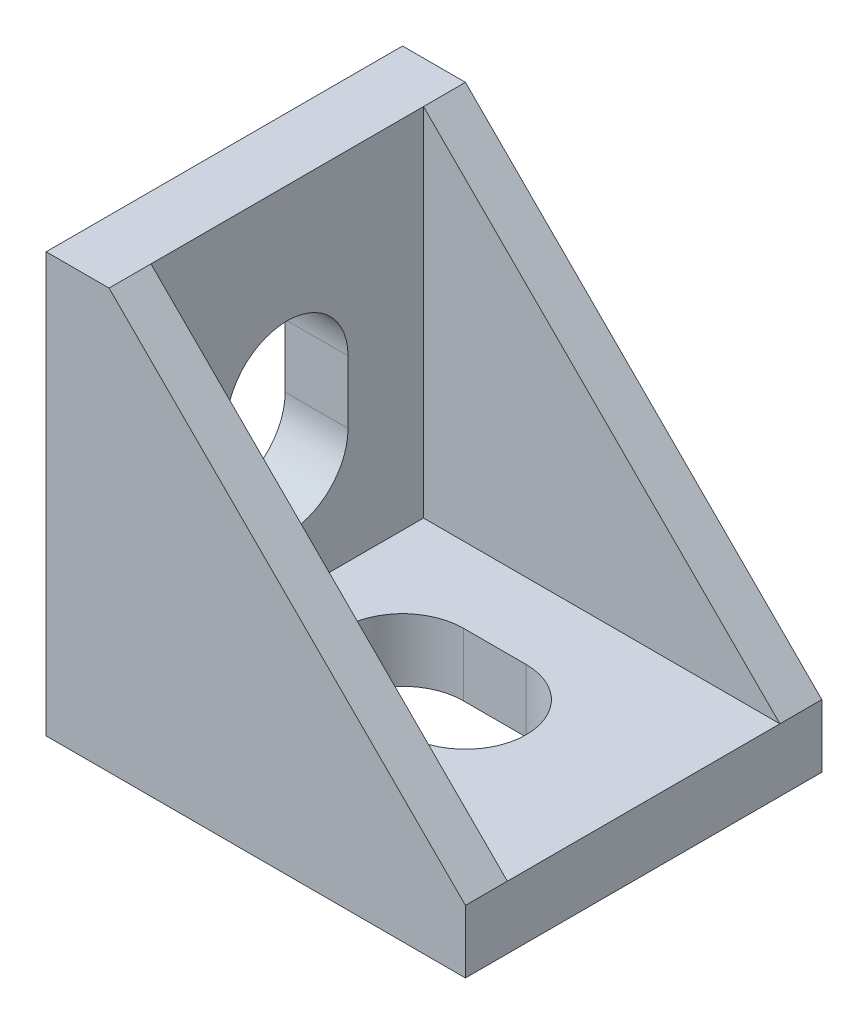
ISO-10303-21;
HEADER;
FILE_DESCRIPTION(('STEP AP214'),'2;1');
FILE_NAME('part.step','',(''),(''),'','','');
FILE_SCHEMA(('AUTOMOTIVE_DESIGN { 1 0 10303 214 1 1 1 1 }'));
ENDSEC;
DATA;
#1=APPLICATION_CONTEXT('core data for automotive mechanical design processes');
#2=APPLICATION_PROTOCOL_DEFINITION('international standard','automotive_design',2000,#1);
#3=PRODUCT_CONTEXT('',#1,'mechanical');
#4=PRODUCT('Part','Part','',(#3));
#5=PRODUCT_RELATED_PRODUCT_CATEGORY('part','',(#4));
#6=PRODUCT_DEFINITION_FORMATION('','',#4);
#7=PRODUCT_DEFINITION_CONTEXT('part definition',#1,'design');
#8=PRODUCT_DEFINITION('design','',#6,#7);
#9=PRODUCT_DEFINITION_SHAPE('','',#8);
#10=(LENGTH_UNIT() NAMED_UNIT(*) SI_UNIT(.MILLI.,.METRE.));
#11=(NAMED_UNIT(*) PLANE_ANGLE_UNIT() SI_UNIT($,.RADIAN.));
#12=(NAMED_UNIT(*) SI_UNIT($,.STERADIAN.) SOLID_ANGLE_UNIT());
#13=UNCERTAINTY_MEASURE_WITH_UNIT(LENGTH_MEASURE(1.E-05),#10,'distance_accuracy_value','');
#14=(GEOMETRIC_REPRESENTATION_CONTEXT(3) GLOBAL_UNCERTAINTY_ASSIGNED_CONTEXT((#13)) GLOBAL_UNIT_ASSIGNED_CONTEXT((#10,
#11,#12)) REPRESENTATION_CONTEXT('',''));
#15=CARTESIAN_POINT('',(0.,0.,0.));
#16=DIRECTION('',(0.,0.,1.));
#17=DIRECTION('',(1.,0.,0.));
#18=AXIS2_PLACEMENT_3D('',#15,#16,#17);
#19=CARTESIAN_POINT('',(0.,0.,8.5));
#20=DIRECTION('',(0.,1.,0.));
#21=DIRECTION('',(0.,0.,1.));
#22=AXIS2_PLACEMENT_3D('',#19,#20,#21);
#23=PLANE('',#22);
#24=DIRECTION('',(-1.,0.,0.));
#25=VECTOR('',#24,1.);
#26=CARTESIAN_POINT('',(1.5,0.,2.));
#27=LINE('',#26,#25);
#28=CARTESIAN_POINT('',(3.34999999999999,0.,2.));
#29=VERTEX_POINT('',#28);
#30=CARTESIAN_POINT('',(1.5,0.,2.));
#31=VERTEX_POINT('',#30);
#32=EDGE_CURVE('E284',#29,#31,#27,.T.);
#33=ORIENTED_EDGE('',*,*,#32,.F.);
#34=DIRECTION('',(0.,0.,-1.));
#35=VECTOR('',#34,1.);
#36=CARTESIAN_POINT('',(3.34999999999999,0.,2.));
#37=LINE('',#36,#35);
#38=CARTESIAN_POINT('',(3.34999999999999,0.,-2.));
#39=VERTEX_POINT('',#38);
#40=EDGE_CURVE('E294',#29,#39,#37,.T.);
#41=ORIENTED_EDGE('',*,*,#40,.T.);
#42=DIRECTION('',(-1.,0.,0.));
#43=VECTOR('',#42,1.);
#44=CARTESIAN_POINT('',(1.5,0.,-2.));
#45=LINE('',#44,#43);
#46=CARTESIAN_POINT('',(1.5,0.,-2.));
#47=VERTEX_POINT('',#46);
#48=EDGE_CURVE('E264',#39,#47,#45,.T.);
#49=ORIENTED_EDGE('',*,*,#48,.T.);
#50=DIRECTION('',(0.,0.,-1.));
#51=VECTOR('',#50,1.);
#52=CARTESIAN_POINT('',(1.5,0.,2.));
#53=LINE('',#52,#51);
#54=EDGE_CURVE('E58',#31,#47,#53,.T.);
#55=ORIENTED_EDGE('',*,*,#54,.F.);
#56=EDGE_LOOP('',(#33,#41,#49,#55));
#57=FACE_BOUND('',#56,.T.);
#58=DIRECTION('',(1.,0.,0.));
#59=VECTOR('',#58,1.);
#60=CARTESIAN_POINT('',(11.5,0.,2.9));
#61=LINE('',#60,#59);
#62=CARTESIAN_POINT('',(8.49999999999996,0.,2.9));
#63=VERTEX_POINT('',#62);
#64=CARTESIAN_POINT('',(11.5,0.,2.9));
#65=VERTEX_POINT('',#64);
#66=EDGE_CURVE('E381',#63,#65,#61,.T.);
#67=ORIENTED_EDGE('',*,*,#66,.T.);
#68=CARTESIAN_POINT('',(11.5,0.,0.));
#69=DIRECTION('',(0.,1.,0.));
#70=DIRECTION('',(-1.,0.,0.));
#71=AXIS2_PLACEMENT_3D('',#68,#69,#70);
#72=CIRCLE('',#71,2.9);
#73=CARTESIAN_POINT('',(11.5,0.,-2.9));
#74=VERTEX_POINT('',#73);
#75=EDGE_CURVE('E371',#65,#74,#72,.T.);
#76=ORIENTED_EDGE('',*,*,#75,.T.);
#77=DIRECTION('',(-1.,0.,0.));
#78=VECTOR('',#77,1.);
#79=CARTESIAN_POINT('',(11.5,0.,-2.9));
#80=LINE('',#79,#78);
#81=CARTESIAN_POINT('',(8.49999999999996,0.,-2.9));
#82=VERTEX_POINT('',#81);
#83=EDGE_CURVE('E374',#74,#82,#80,.T.);
#84=ORIENTED_EDGE('',*,*,#83,.T.);
#85=CARTESIAN_POINT('',(8.49999999999996,0.,0.));
#86=DIRECTION('',(0.,1.,0.));
#87=DIRECTION('',(-1.,0.,0.));
#88=AXIS2_PLACEMENT_3D('',#85,#86,#87);
#89=CIRCLE('',#88,2.9);
#90=EDGE_CURVE('E378',#82,#63,#89,.T.);
#91=ORIENTED_EDGE('',*,*,#90,.T.);
#92=EDGE_LOOP('',(#67,#76,#84,#91));
#93=FACE_BOUND('',#92,.T.);
#94=DIRECTION('',(1.,0.,0.));
#95=VECTOR('',#94,1.);
#96=CARTESIAN_POINT('',(0.,0.,-8.5));
#97=LINE('',#96,#95);
#98=CARTESIAN_POINT('',(0.,0.,-8.5));
#99=VERTEX_POINT('',#98);
#100=CARTESIAN_POINT('',(20.,0.,-8.5));
#101=VERTEX_POINT('',#100);
#102=EDGE_CURVE('E469',#99,#101,#97,.T.);
#103=ORIENTED_EDGE('',*,*,#102,.T.);
#104=DIRECTION('',(0.,0.,-1.));
#105=VECTOR('',#104,1.);
#106=CARTESIAN_POINT('',(20.,0.,8.5));
#107=LINE('',#106,#105);
#108=CARTESIAN_POINT('',(20.,0.,8.5));
#109=VERTEX_POINT('',#108);
#110=EDGE_CURVE('E483',#109,#101,#107,.T.);
#111=ORIENTED_EDGE('',*,*,#110,.F.);
#112=DIRECTION('',(1.,0.,0.));
#113=VECTOR('',#112,1.);
#114=CARTESIAN_POINT('',(0.,0.,8.5));
#115=LINE('',#114,#113);
#116=CARTESIAN_POINT('',(0.,0.,8.5));
#117=VERTEX_POINT('',#116);
#118=EDGE_CURVE('E458',#117,#109,#115,.T.);
#119=ORIENTED_EDGE('',*,*,#118,.F.);
#120=DIRECTION('',(0.,0.,-1.));
#121=VECTOR('',#120,1.);
#122=CARTESIAN_POINT('',(0.,0.,8.5));
#123=LINE('',#122,#121);
#124=EDGE_CURVE('E486',#117,#99,#123,.T.);
#125=ORIENTED_EDGE('',*,*,#124,.T.);
#126=EDGE_LOOP('',(#103,#111,#119,#125));
#127=FACE_BOUND('',#126,.T.);
#128=DIRECTION('',(-1.,0.,0.));
#129=VECTOR('',#128,1.);
#130=CARTESIAN_POINT('',(18.5,0.,2.));
#131=LINE('',#130,#129);
#132=CARTESIAN_POINT('',(18.5,0.,2.));
#133=VERTEX_POINT('',#132);
#134=CARTESIAN_POINT('',(16.65,0.,2.));
#135=VERTEX_POINT('',#134);
#136=EDGE_CURVE('E247',#133,#135,#131,.T.);
#137=ORIENTED_EDGE('',*,*,#136,.F.);
#138=DIRECTION('',(0.,0.,-1.));
#139=VECTOR('',#138,1.);
#140=CARTESIAN_POINT('',(18.5,0.,2.));
#141=LINE('',#140,#139);
#142=CARTESIAN_POINT('',(18.5,0.,-2.));
#143=VERTEX_POINT('',#142);
#144=EDGE_CURVE('E258',#133,#143,#141,.T.);
#145=ORIENTED_EDGE('',*,*,#144,.T.);
#146=DIRECTION('',(-1.,0.,0.));
#147=VECTOR('',#146,1.);
#148=CARTESIAN_POINT('',(18.5,0.,-2.));
#149=LINE('',#148,#147);
#150=CARTESIAN_POINT('',(16.65,0.,-2.));
#151=VERTEX_POINT('',#150);
#152=EDGE_CURVE('E275',#143,#151,#149,.T.);
#153=ORIENTED_EDGE('',*,*,#152,.T.);
#154=DIRECTION('',(0.,0.,-1.));
#155=VECTOR('',#154,1.);
#156=CARTESIAN_POINT('',(16.65,0.,2.));
#157=LINE('',#156,#155);
#158=EDGE_CURVE('E265',#135,#151,#157,.T.);
#159=ORIENTED_EDGE('',*,*,#158,.F.);
#160=EDGE_LOOP('',(#137,#145,#153,#159));
#161=FACE_BOUND('',#160,.T.);
#162=ADVANCED_FACE('F35',(#57,#93,#127,#161),#23,.F.);
#163=CARTESIAN_POINT('',(0.,20.,8.5));
#164=DIRECTION('',(1.,0.,0.));
#165=DIRECTION('',(0.,1.,0.));
#166=AXIS2_PLACEMENT_3D('',#163,#164,#165);
#167=PLANE('',#166);
#168=DIRECTION('',(0.,1.,0.));
#169=VECTOR('',#168,1.);
#170=CARTESIAN_POINT('',(0.,18.5,2.));
#171=LINE('',#170,#169);
#172=CARTESIAN_POINT('',(0.,16.65,2.));
#173=VERTEX_POINT('',#172);
#174=CARTESIAN_POINT('',(0.,18.5,2.));
#175=VERTEX_POINT('',#174);
#176=EDGE_CURVE('E342',#173,#175,#171,.T.);
#177=ORIENTED_EDGE('',*,*,#176,.F.);
#178=DIRECTION('',(0.,0.,-1.));
#179=VECTOR('',#178,1.);
#180=CARTESIAN_POINT('',(0.,16.65,2.));
#181=LINE('',#180,#179);
#182=CARTESIAN_POINT('',(0.,16.65,-2.));
#183=VERTEX_POINT('',#182);
#184=EDGE_CURVE('E352',#173,#183,#181,.T.);
#185=ORIENTED_EDGE('',*,*,#184,.T.);
#186=DIRECTION('',(0.,1.,0.));
#187=VECTOR('',#186,1.);
#188=CARTESIAN_POINT('',(0.,18.5,-2.));
#189=LINE('',#188,#187);
#190=CARTESIAN_POINT('',(0.,18.5,-2.));
#191=VERTEX_POINT('',#190);
#192=EDGE_CURVE('E341',#183,#191,#189,.T.);
#193=ORIENTED_EDGE('',*,*,#192,.T.);
#194=DIRECTION('',(0.,0.,-1.));
#195=VECTOR('',#194,1.);
#196=CARTESIAN_POINT('',(0.,18.5,2.));
#197=LINE('',#196,#195);
#198=EDGE_CURVE('E368',#175,#191,#197,.T.);
#199=ORIENTED_EDGE('',*,*,#198,.F.);
#200=EDGE_LOOP('',(#177,#185,#193,#199));
#201=FACE_BOUND('',#200,.T.);
#202=DIRECTION('',(0.,1.,0.));
#203=VECTOR('',#202,1.);
#204=CARTESIAN_POINT('',(0.,8.50000000000005,2.9));
#205=LINE('',#204,#203);
#206=CARTESIAN_POINT('',(0.,8.50000000000005,2.9));
#207=VERTEX_POINT('',#206);
#208=CARTESIAN_POINT('',(0.,11.5,2.9));
#209=VERTEX_POINT('',#208);
#210=EDGE_CURVE('E404',#207,#209,#205,.T.);
#211=ORIENTED_EDGE('',*,*,#210,.F.);
#212=CARTESIAN_POINT('',(0.,8.50000000000005,0.));
#213=DIRECTION('',(1.,0.,0.));
#214=DIRECTION('',(0.,1.,0.));
#215=AXIS2_PLACEMENT_3D('',#212,#213,#214);
#216=CIRCLE('',#215,2.9);
#217=CARTESIAN_POINT('',(0.,8.50000000000004,-2.9));
#218=VERTEX_POINT('',#217);
#219=EDGE_CURVE('E407',#218,#207,#216,.F.);
#220=ORIENTED_EDGE('',*,*,#219,.F.);
#221=DIRECTION('',(0.,-1.,0.));
#222=VECTOR('',#221,1.);
#223=CARTESIAN_POINT('',(0.,8.50000000000005,-2.9));
#224=LINE('',#223,#222);
#225=CARTESIAN_POINT('',(0.,11.5,-2.9));
#226=VERTEX_POINT('',#225);
#227=EDGE_CURVE('E424',#226,#218,#224,.T.);
#228=ORIENTED_EDGE('',*,*,#227,.F.);
#229=CARTESIAN_POINT('',(0.,11.5,0.));
#230=DIRECTION('',(1.,0.,0.));
#231=DIRECTION('',(0.,1.,0.));
#232=AXIS2_PLACEMENT_3D('',#229,#230,#231);
#233=CIRCLE('',#232,2.9);
#234=EDGE_CURVE('E396',#209,#226,#233,.F.);
#235=ORIENTED_EDGE('',*,*,#234,.F.);
#236=EDGE_LOOP('',(#211,#220,#228,#235));
#237=FACE_BOUND('',#236,.T.);
#238=DIRECTION('',(0.,-1.,0.));
#239=VECTOR('',#238,1.);
#240=CARTESIAN_POINT('',(0.,20.,-8.5));
#241=LINE('',#240,#239);
#242=CARTESIAN_POINT('',(0.,20.,-8.5));
#243=VERTEX_POINT('',#242);
#244=EDGE_CURVE('E467',#243,#99,#241,.T.);
#245=ORIENTED_EDGE('',*,*,#244,.T.);
#246=ORIENTED_EDGE('',*,*,#124,.F.);
#247=DIRECTION('',(0.,-1.,0.));
#248=VECTOR('',#247,1.);
#249=CARTESIAN_POINT('',(0.,20.,8.5));
#250=LINE('',#249,#248);
#251=CARTESIAN_POINT('',(0.,20.,8.5));
#252=VERTEX_POINT('',#251);
#253=EDGE_CURVE('E455',#252,#117,#250,.T.);
#254=ORIENTED_EDGE('',*,*,#253,.F.);
#255=DIRECTION('',(0.,0.,-1.));
#256=VECTOR('',#255,1.);
#257=CARTESIAN_POINT('',(0.,20.,8.5));
#258=LINE('',#257,#256);
#259=EDGE_CURVE('E489',#252,#243,#258,.T.);
#260=ORIENTED_EDGE('',*,*,#259,.T.);
#261=EDGE_LOOP('',(#245,#246,#254,#260));
#262=FACE_BOUND('',#261,.T.);
#263=DIRECTION('',(0.,1.,0.));
#264=VECTOR('',#263,1.);
#265=CARTESIAN_POINT('',(0.,1.5,2.));
#266=LINE('',#265,#264);
#267=CARTESIAN_POINT('',(0.,1.5,2.));
#268=VERTEX_POINT('',#267);
#269=CARTESIAN_POINT('',(0.,3.35,2.));
#270=VERTEX_POINT('',#269);
#271=EDGE_CURVE('E314',#268,#270,#266,.T.);
#272=ORIENTED_EDGE('',*,*,#271,.F.);
#273=DIRECTION('',(0.,0.,-1.));
#274=VECTOR('',#273,1.);
#275=CARTESIAN_POINT('',(0.,1.5,2.));
#276=LINE('',#275,#274);
#277=CARTESIAN_POINT('',(0.,1.5,-2.));
#278=VERTEX_POINT('',#277);
#279=EDGE_CURVE('E338',#268,#278,#276,.T.);
#280=ORIENTED_EDGE('',*,*,#279,.T.);
#281=DIRECTION('',(0.,1.,0.));
#282=VECTOR('',#281,1.);
#283=CARTESIAN_POINT('',(0.,1.5,-2.));
#284=LINE('',#283,#282);
#285=CARTESIAN_POINT('',(0.,3.35,-2.));
#286=VERTEX_POINT('',#285);
#287=EDGE_CURVE('E324',#278,#286,#284,.T.);
#288=ORIENTED_EDGE('',*,*,#287,.T.);
#289=DIRECTION('',(0.,0.,-1.));
#290=VECTOR('',#289,1.);
#291=CARTESIAN_POINT('',(0.,3.35,2.));
#292=LINE('',#291,#290);
#293=EDGE_CURVE('E335',#270,#286,#292,.T.);
#294=ORIENTED_EDGE('',*,*,#293,.F.);
#295=EDGE_LOOP('',(#272,#280,#288,#294));
#296=FACE_BOUND('',#295,.T.);
#297=ADVANCED_FACE('F530',(#201,#237,#262,#296),#167,.F.);
#298=CARTESIAN_POINT('',(20.,3.,8.5));
#299=DIRECTION('',(-0.707106781186547,-0.707106781186547,0.));
#300=DIRECTION('',(0.707106781186548,-0.707106781186548,0.));
#301=AXIS2_PLACEMENT_3D('',#298,#299,#300);
#302=PLANE('',#301);
#303=DIRECTION('',(0.,0.,-1.));
#304=VECTOR('',#303,1.);
#305=CARTESIAN_POINT('',(3.,20.,8.5));
#306=LINE('',#305,#304);
#307=CARTESIAN_POINT('',(3.,20.,-6.5));
#308=VERTEX_POINT('',#307);
#309=CARTESIAN_POINT('',(3.,20.,-8.5));
#310=VERTEX_POINT('',#309);
#311=EDGE_CURVE('E464',#308,#310,#306,.T.);
#312=ORIENTED_EDGE('',*,*,#311,.F.);
#313=DIRECTION('',(0.707106781186548,-0.707106781186548,0.));
#314=VECTOR('',#313,1.);
#315=CARTESIAN_POINT('',(20.,3.,-6.5));
#316=LINE('',#315,#314);
#317=CARTESIAN_POINT('',(20.,2.99999999999995,-6.5));
#318=VERTEX_POINT('',#317);
#319=EDGE_CURVE('E11',#308,#318,#316,.T.);
#320=ORIENTED_EDGE('',*,*,#319,.T.);
#321=DIRECTION('',(0.,0.,-1.));
#322=VECTOR('',#321,1.);
#323=CARTESIAN_POINT('',(20.,3.,8.5));
#324=LINE('',#323,#322);
#325=CARTESIAN_POINT('',(20.,3.,-8.5));
#326=VERTEX_POINT('',#325);
#327=EDGE_CURVE('E479',#318,#326,#324,.T.);
#328=ORIENTED_EDGE('',*,*,#327,.T.);
#329=DIRECTION('',(-0.707106781186548,0.707106781186548,0.));
#330=VECTOR('',#329,1.);
#331=CARTESIAN_POINT('',(20.,3.,-8.5));
#332=LINE('',#331,#330);
#333=EDGE_CURVE('E456',#326,#310,#332,.T.);
#334=ORIENTED_EDGE('',*,*,#333,.T.);
#335=EDGE_LOOP('',(#312,#320,#328,#334));
#336=FACE_BOUND('',#335,.T.);
#337=ADVANCED_FACE('F522',(#336),#302,.F.);
#338=CARTESIAN_POINT('',(3.,20.,8.5));
#339=DIRECTION('',(0.,-1.,0.));
#340=DIRECTION('',(1.,0.,0.));
#341=AXIS2_PLACEMENT_3D('',#338,#339,#340);
#342=PLANE('',#341);
#343=DIRECTION('',(-1.,0.,0.));
#344=VECTOR('',#343,1.);
#345=CARTESIAN_POINT('',(3.,20.,-8.5));
#346=LINE('',#345,#344);
#347=EDGE_CURVE('E450',#310,#243,#346,.T.);
#348=ORIENTED_EDGE('',*,*,#347,.T.);
#349=ORIENTED_EDGE('',*,*,#259,.F.);
#350=DIRECTION('',(-1.,0.,0.));
#351=VECTOR('',#350,1.);
#352=CARTESIAN_POINT('',(3.,20.,8.5));
#353=LINE('',#352,#351);
#354=CARTESIAN_POINT('',(3.,20.,8.5));
#355=VERTEX_POINT('',#354);
#356=EDGE_CURVE('E452',#355,#252,#353,.T.);
#357=ORIENTED_EDGE('',*,*,#356,.F.);
#358=CARTESIAN_POINT('',(3.,20.,6.5));
#359=VERTEX_POINT('',#358);
#360=EDGE_CURVE('E476',#355,#359,#306,.T.);
#361=ORIENTED_EDGE('',*,*,#360,.T.);
#362=DIRECTION('',(0.,0.,1.));
#363=VECTOR('',#362,1.);
#364=CARTESIAN_POINT('',(3.,20.,-6.5));
#365=LINE('',#364,#363);
#366=EDGE_CURVE('E433',#308,#359,#365,.T.);
#367=ORIENTED_EDGE('',*,*,#366,.F.);
#368=ORIENTED_EDGE('',*,*,#311,.T.);
#369=EDGE_LOOP('',(#348,#349,#357,#361,#367,#368));
#370=FACE_BOUND('',#369,.T.);
#371=ADVANCED_FACE('F37',(#370),#342,.F.);
#372=CARTESIAN_POINT('',(20.,0.,8.5));
#373=DIRECTION('',(-1.,0.,0.));
#374=DIRECTION('',(0.,-1.,0.));
#375=AXIS2_PLACEMENT_3D('',#372,#373,#374);
#376=PLANE('',#375);
#377=DIRECTION('',(0.,1.,0.));
#378=VECTOR('',#377,1.);
#379=CARTESIAN_POINT('',(20.,0.,-8.5));
#380=LINE('',#379,#378);
#381=EDGE_CURVE('E471',#101,#326,#380,.T.);
#382=ORIENTED_EDGE('',*,*,#381,.T.);
#383=ORIENTED_EDGE('',*,*,#327,.F.);
#384=DIRECTION('',(0.,0.,-1.));
#385=VECTOR('',#384,1.);
#386=CARTESIAN_POINT('',(20.,2.99999999999995,-6.5));
#387=LINE('',#386,#385);
#388=CARTESIAN_POINT('',(20.,2.99999999999995,6.5));
#389=VERTEX_POINT('',#388);
#390=EDGE_CURVE('E440',#389,#318,#387,.T.);
#391=ORIENTED_EDGE('',*,*,#390,.F.);
#392=CARTESIAN_POINT('',(20.,3.,8.5));
#393=VERTEX_POINT('',#392);
#394=EDGE_CURVE('E480',#393,#389,#324,.T.);
#395=ORIENTED_EDGE('',*,*,#394,.F.);
#396=DIRECTION('',(0.,1.,0.));
#397=VECTOR('',#396,1.);
#398=CARTESIAN_POINT('',(20.,0.,8.5));
#399=LINE('',#398,#397);
#400=EDGE_CURVE('E460',#109,#393,#399,.T.);
#401=ORIENTED_EDGE('',*,*,#400,.F.);
#402=ORIENTED_EDGE('',*,*,#110,.T.);
#403=EDGE_LOOP('',(#382,#383,#391,#395,#401,#402));
#404=FACE_BOUND('',#403,.T.);
#405=ADVANCED_FACE('F511',(#404),#376,.F.);
#406=ORIENTED_EDGE('',*,*,#394,.T.);
#407=DIRECTION('',(-0.707106781186548,0.707106781186548,0.));
#408=VECTOR('',#407,1.);
#409=CARTESIAN_POINT('',(20.,3.,6.5));
#410=LINE('',#409,#408);
#411=EDGE_CURVE('E43',#389,#359,#410,.T.);
#412=ORIENTED_EDGE('',*,*,#411,.T.);
#413=ORIENTED_EDGE('',*,*,#360,.F.);
#414=DIRECTION('',(-0.707106781186548,0.707106781186548,0.));
#415=VECTOR('',#414,1.);
#416=CARTESIAN_POINT('',(20.,3.,8.5));
#417=LINE('',#416,#415);
#418=EDGE_CURVE('E462',#393,#355,#417,.T.);
#419=ORIENTED_EDGE('',*,*,#418,.F.);
#420=EDGE_LOOP('',(#406,#412,#413,#419));
#421=FACE_BOUND('',#420,.T.);
#422=ADVANCED_FACE('F494',(#421),#302,.F.);
#423=CARTESIAN_POINT('',(0.,0.,8.5));
#424=DIRECTION('',(0.,0.,1.));
#425=DIRECTION('',(1.,0.,0.));
#426=AXIS2_PLACEMENT_3D('',#423,#424,#425);
#427=PLANE('',#426);
#428=ORIENTED_EDGE('',*,*,#356,.T.);
#429=ORIENTED_EDGE('',*,*,#253,.T.);
#430=ORIENTED_EDGE('',*,*,#118,.T.);
#431=ORIENTED_EDGE('',*,*,#400,.T.);
#432=ORIENTED_EDGE('',*,*,#418,.T.);
#433=EDGE_LOOP('',(#428,#429,#430,#431,#432));
#434=FACE_BOUND('',#433,.T.);
#435=ADVANCED_FACE('F504',(#434),#427,.T.);
#436=CARTESIAN_POINT('',(0.,0.,-8.5));
#437=DIRECTION('',(0.,0.,1.));
#438=DIRECTION('',(1.,0.,0.));
#439=AXIS2_PLACEMENT_3D('',#436,#437,#438);
#440=PLANE('',#439);
#441=ORIENTED_EDGE('',*,*,#347,.F.);
#442=ORIENTED_EDGE('',*,*,#333,.F.);
#443=ORIENTED_EDGE('',*,*,#381,.F.);
#444=ORIENTED_EDGE('',*,*,#102,.F.);
#445=ORIENTED_EDGE('',*,*,#244,.F.);
#446=EDGE_LOOP('',(#441,#442,#443,#444,#445));
#447=FACE_BOUND('',#446,.T.);
#448=ADVANCED_FACE('F526',(#447),#440,.F.);
#449=CARTESIAN_POINT('',(2.99999999999996,2.99999999999999,-6.5));
#450=DIRECTION('',(0.,0.,-1.));
#451=DIRECTION('',(-1.,0.,0.));
#452=AXIS2_PLACEMENT_3D('',#449,#450,#451);
#453=PLANE('',#452);
#454=DIRECTION('',(0.,1.,0.));
#455=VECTOR('',#454,1.);
#456=CARTESIAN_POINT('',(2.99999999999996,2.99999999999999,-6.5));
#457=LINE('',#456,#455);
#458=CARTESIAN_POINT('',(2.99999999999996,2.99999999999999,-6.5));
#459=VERTEX_POINT('',#458);
#460=EDGE_CURVE('E448',#459,#308,#457,.T.);
#461=ORIENTED_EDGE('',*,*,#460,.F.);
#462=DIRECTION('',(-1.,0.,0.));
#463=VECTOR('',#462,1.);
#464=CARTESIAN_POINT('',(2.99999999999996,2.99999999999999,-6.5));
#465=LINE('',#464,#463);
#466=EDGE_CURVE('E442',#318,#459,#465,.T.);
#467=ORIENTED_EDGE('',*,*,#466,.F.);
#468=ORIENTED_EDGE('',*,*,#319,.F.);
#469=EDGE_LOOP('',(#461,#467,#468));
#470=FACE_BOUND('',#469,.T.);
#471=ADVANCED_FACE('F518',(#470),#453,.F.);
#472=CARTESIAN_POINT('',(2.99999999999996,2.99999999999999,6.5));
#473=DIRECTION('',(0.,0.,1.));
#474=DIRECTION('',(1.,0.,0.));
#475=AXIS2_PLACEMENT_3D('',#472,#473,#474);
#476=PLANE('',#475);
#477=DIRECTION('',(1.,0.,0.));
#478=VECTOR('',#477,1.);
#479=CARTESIAN_POINT('',(2.99999999999996,2.99999999999999,6.5));
#480=LINE('',#479,#478);
#481=CARTESIAN_POINT('',(2.99999999999996,2.99999999999999,6.5));
#482=VERTEX_POINT('',#481);
#483=EDGE_CURVE('E437',#482,#389,#480,.T.);
#484=ORIENTED_EDGE('',*,*,#483,.F.);
#485=DIRECTION('',(0.,1.,0.));
#486=VECTOR('',#485,1.);
#487=CARTESIAN_POINT('',(2.99999999999996,2.99999999999999,6.5));
#488=LINE('',#487,#486);
#489=EDGE_CURVE('E445',#482,#359,#488,.T.);
#490=ORIENTED_EDGE('',*,*,#489,.T.);
#491=ORIENTED_EDGE('',*,*,#411,.F.);
#492=EDGE_LOOP('',(#484,#490,#491));
#493=FACE_BOUND('',#492,.T.);
#494=ADVANCED_FACE('F554',(#493),#476,.F.);
#495=CARTESIAN_POINT('',(2.99999999999996,2.99999999999999,-6.5));
#496=DIRECTION('',(-1.,0.,0.));
#497=DIRECTION('',(0.,-1.,0.));
#498=AXIS2_PLACEMENT_3D('',#495,#496,#497);
#499=PLANE('',#498);
#500=DIRECTION('',(0.,1.,0.));
#501=VECTOR('',#500,1.);
#502=CARTESIAN_POINT('',(2.99999999999998,8.50000000000004,-2.9));
#503=LINE('',#502,#501);
#504=CARTESIAN_POINT('',(2.99999999999998,8.50000000000004,-2.9));
#505=VERTEX_POINT('',#504);
#506=CARTESIAN_POINT('',(2.99999999999998,11.5,-2.9));
#507=VERTEX_POINT('',#506);
#508=EDGE_CURVE('E412',#505,#507,#503,.T.);
#509=ORIENTED_EDGE('',*,*,#508,.F.);
#510=CARTESIAN_POINT('',(2.99999999999998,8.50000000000004,0.));
#511=DIRECTION('',(1.,0.,0.));
#512=DIRECTION('',(0.,1.,0.));
#513=AXIS2_PLACEMENT_3D('',#510,#511,#512);
#514=CIRCLE('',#513,2.9);
#515=CARTESIAN_POINT('',(2.99999999999998,8.50000000000004,2.9));
#516=VERTEX_POINT('',#515);
#517=EDGE_CURVE('E410',#516,#505,#514,.T.);
#518=ORIENTED_EDGE('',*,*,#517,.F.);
#519=DIRECTION('',(0.,-1.,0.));
#520=VECTOR('',#519,1.);
#521=CARTESIAN_POINT('',(2.99999999999998,8.50000000000004,2.9));
#522=LINE('',#521,#520);
#523=CARTESIAN_POINT('',(2.99999999999998,11.5,2.9));
#524=VERTEX_POINT('',#523);
#525=EDGE_CURVE('E418',#524,#516,#522,.T.);
#526=ORIENTED_EDGE('',*,*,#525,.F.);
#527=CARTESIAN_POINT('',(2.99999999999998,11.5,0.));
#528=DIRECTION('',(1.,0.,0.));
#529=DIRECTION('',(0.,1.,0.));
#530=AXIS2_PLACEMENT_3D('',#527,#528,#529);
#531=CIRCLE('',#530,2.9);
#532=EDGE_CURVE('E415',#507,#524,#531,.T.);
#533=ORIENTED_EDGE('',*,*,#532,.F.);
#534=EDGE_LOOP('',(#509,#518,#526,#533));
#535=FACE_BOUND('',#534,.T.);
#536=ORIENTED_EDGE('',*,*,#366,.T.);
#537=ORIENTED_EDGE('',*,*,#489,.F.);
#538=DIRECTION('',(0.,0.,1.));
#539=VECTOR('',#538,1.);
#540=CARTESIAN_POINT('',(2.99999999999996,2.99999999999999,-6.5));
#541=LINE('',#540,#539);
#542=EDGE_CURVE('E434',#459,#482,#541,.T.);
#543=ORIENTED_EDGE('',*,*,#542,.F.);
#544=ORIENTED_EDGE('',*,*,#460,.T.);
#545=EDGE_LOOP('',(#536,#537,#543,#544));
#546=FACE_BOUND('',#545,.T.);
#547=ADVANCED_FACE('F551',(#535,#546),#499,.F.);
#548=CARTESIAN_POINT('',(0.,3.,0.));
#549=DIRECTION('',(0.,1.,0.));
#550=DIRECTION('',(-1.,0.,0.));
#551=AXIS2_PLACEMENT_3D('',#548,#549,#550);
#552=PLANE('',#551);
#553=CARTESIAN_POINT('',(11.5,2.99999999999997,0.));
#554=DIRECTION('',(0.,1.,0.));
#555=DIRECTION('',(-1.,0.,0.));
#556=AXIS2_PLACEMENT_3D('',#553,#554,#555);
#557=CIRCLE('',#556,2.9);
#558=CARTESIAN_POINT('',(11.5,2.99999999999997,2.9));
#559=VERTEX_POINT('',#558);
#560=CARTESIAN_POINT('',(11.5,2.99999999999997,-2.9));
#561=VERTEX_POINT('',#560);
#562=EDGE_CURVE('E370',#559,#561,#557,.T.);
#563=ORIENTED_EDGE('',*,*,#562,.F.);
#564=DIRECTION('',(1.,0.,0.));
#565=VECTOR('',#564,1.);
#566=CARTESIAN_POINT('',(11.5,2.99999999999997,2.9));
#567=LINE('',#566,#565);
#568=CARTESIAN_POINT('',(8.49999999999997,2.99999999999998,2.9));
#569=VERTEX_POINT('',#568);
#570=EDGE_CURVE('E375',#569,#559,#567,.T.);
#571=ORIENTED_EDGE('',*,*,#570,.F.);
#572=CARTESIAN_POINT('',(8.49999999999997,2.99999999999998,0.));
#573=DIRECTION('',(0.,1.,0.));
#574=DIRECTION('',(-1.,0.,0.));
#575=AXIS2_PLACEMENT_3D('',#572,#573,#574);
#576=CIRCLE('',#575,2.9);
#577=CARTESIAN_POINT('',(8.49999999999997,2.99999999999998,-2.9));
#578=VERTEX_POINT('',#577);
#579=EDGE_CURVE('E389',#578,#569,#576,.T.);
#580=ORIENTED_EDGE('',*,*,#579,.F.);
#581=DIRECTION('',(-1.,0.,0.));
#582=VECTOR('',#581,1.);
#583=CARTESIAN_POINT('',(11.5,2.99999999999997,-2.9));
#584=LINE('',#583,#582);
#585=EDGE_CURVE('E386',#561,#578,#584,.T.);
#586=ORIENTED_EDGE('',*,*,#585,.F.);
#587=EDGE_LOOP('',(#563,#571,#580,#586));
#588=FACE_BOUND('',#587,.T.);
#589=ORIENTED_EDGE('',*,*,#542,.T.);
#590=ORIENTED_EDGE('',*,*,#483,.T.);
#591=ORIENTED_EDGE('',*,*,#390,.T.);
#592=ORIENTED_EDGE('',*,*,#466,.T.);
#593=EDGE_LOOP('',(#589,#590,#591,#592));
#594=FACE_BOUND('',#593,.T.);
#595=ADVANCED_FACE('F515',(#588,#594),#552,.T.);
#596=CARTESIAN_POINT('',(-0.00100000000002789,8.50000000000005,0.));
#597=DIRECTION('',(1.,0.,0.));
#598=DIRECTION('',(0.,1.,0.));
#599=AXIS2_PLACEMENT_3D('',#596,#597,#598);
#600=CYLINDRICAL_SURFACE('',#599,2.9);
#601=ORIENTED_EDGE('',*,*,#219,.T.);
#602=DIRECTION('',(1.,0.,0.));
#603=VECTOR('',#602,1.);
#604=CARTESIAN_POINT('',(-0.00100000000002745,8.50000000000005,2.9));
#605=LINE('',#604,#603);
#606=EDGE_CURVE('E422',#207,#516,#605,.T.);
#607=ORIENTED_EDGE('',*,*,#606,.T.);
#608=ORIENTED_EDGE('',*,*,#517,.T.);
#609=DIRECTION('',(1.,0.,0.));
#610=VECTOR('',#609,1.);
#611=CARTESIAN_POINT('',(-0.00100000000002832,8.50000000000005,-2.9));
#612=LINE('',#611,#610);
#613=EDGE_CURVE('E421',#218,#505,#612,.T.);
#614=ORIENTED_EDGE('',*,*,#613,.F.);
#615=EDGE_LOOP('',(#601,#607,#608,#614));
#616=FACE_BOUND('',#615,.T.);
#617=ADVANCED_FACE('F562',(#616),#600,.F.);
#618=CARTESIAN_POINT('',(-0.00100000000002745,8.50000000000005,2.9));
#619=DIRECTION('',(0.,0.,1.));
#620=DIRECTION('',(0.,-1.,0.));
#621=AXIS2_PLACEMENT_3D('',#618,#619,#620);
#622=PLANE('',#621);
#623=ORIENTED_EDGE('',*,*,#210,.T.);
#624=DIRECTION('',(1.,0.,0.));
#625=VECTOR('',#624,1.);
#626=CARTESIAN_POINT('',(-0.00100000000002052,11.5,2.9));
#627=LINE('',#626,#625);
#628=EDGE_CURVE('E425',#209,#524,#627,.T.);
#629=ORIENTED_EDGE('',*,*,#628,.T.);
#630=ORIENTED_EDGE('',*,*,#525,.T.);
#631=ORIENTED_EDGE('',*,*,#606,.F.);
#632=EDGE_LOOP('',(#623,#629,#630,#631));
#633=FACE_BOUND('',#632,.T.);
#634=ADVANCED_FACE('F566',(#633),#622,.F.);
#635=CARTESIAN_POINT('',(-0.00100000000002095,11.5,0.));
#636=DIRECTION('',(1.,0.,0.));
#637=DIRECTION('',(0.,1.,0.));
#638=AXIS2_PLACEMENT_3D('',#635,#636,#637);
#639=CYLINDRICAL_SURFACE('',#638,2.9);
#640=ORIENTED_EDGE('',*,*,#234,.T.);
#641=DIRECTION('',(1.,0.,0.));
#642=VECTOR('',#641,1.);
#643=CARTESIAN_POINT('',(-0.00100000000002138,11.5,-2.9));
#644=LINE('',#643,#642);
#645=EDGE_CURVE('E427',#226,#507,#644,.T.);
#646=ORIENTED_EDGE('',*,*,#645,.T.);
#647=ORIENTED_EDGE('',*,*,#532,.T.);
#648=ORIENTED_EDGE('',*,*,#628,.F.);
#649=EDGE_LOOP('',(#640,#646,#647,#648));
#650=FACE_BOUND('',#649,.T.);
#651=ADVANCED_FACE('F572',(#650),#639,.F.);
#652=CARTESIAN_POINT('',(-0.00100000000002832,8.50000000000005,-2.9));
#653=DIRECTION('',(0.,0.,-1.));
#654=DIRECTION('',(0.,1.,0.));
#655=AXIS2_PLACEMENT_3D('',#652,#653,#654);
#656=PLANE('',#655);
#657=ORIENTED_EDGE('',*,*,#227,.T.);
#658=ORIENTED_EDGE('',*,*,#613,.T.);
#659=ORIENTED_EDGE('',*,*,#508,.T.);
#660=ORIENTED_EDGE('',*,*,#645,.F.);
#661=EDGE_LOOP('',(#657,#658,#659,#660));
#662=FACE_BOUND('',#661,.T.);
#663=ADVANCED_FACE('F568',(#662),#656,.F.);
#664=CARTESIAN_POINT('',(11.5,0.,0.));
#665=DIRECTION('',(0.,1.,0.));
#666=DIRECTION('',(-1.,0.,0.));
#667=AXIS2_PLACEMENT_3D('',#664,#665,#666);
#668=CYLINDRICAL_SURFACE('',#667,2.9);
#669=ORIENTED_EDGE('',*,*,#562,.T.);
#670=DIRECTION('',(0.,1.,0.));
#671=VECTOR('',#670,1.);
#672=CARTESIAN_POINT('',(11.5,0.,-2.9));
#673=LINE('',#672,#671);
#674=EDGE_CURVE('E384',#74,#561,#673,.T.);
#675=ORIENTED_EDGE('',*,*,#674,.F.);
#676=ORIENTED_EDGE('',*,*,#75,.F.);
#677=DIRECTION('',(0.,1.,0.));
#678=VECTOR('',#677,1.);
#679=CARTESIAN_POINT('',(11.5,0.,2.9));
#680=LINE('',#679,#678);
#681=EDGE_CURVE('E394',#65,#559,#680,.T.);
#682=ORIENTED_EDGE('',*,*,#681,.T.);
#683=EDGE_LOOP('',(#669,#675,#676,#682));
#684=FACE_BOUND('',#683,.T.);
#685=ADVANCED_FACE('F571',(#684),#668,.F.);
#686=CARTESIAN_POINT('',(11.5,0.,2.9));
#687=DIRECTION('',(0.,0.,1.));
#688=DIRECTION('',(1.,0.,0.));
#689=AXIS2_PLACEMENT_3D('',#686,#687,#688);
#690=PLANE('',#689);
#691=ORIENTED_EDGE('',*,*,#570,.T.);
#692=ORIENTED_EDGE('',*,*,#681,.F.);
#693=ORIENTED_EDGE('',*,*,#66,.F.);
#694=DIRECTION('',(0.,1.,0.));
#695=VECTOR('',#694,1.);
#696=CARTESIAN_POINT('',(8.49999999999996,0.,2.9));
#697=LINE('',#696,#695);
#698=EDGE_CURVE('E397',#63,#569,#697,.T.);
#699=ORIENTED_EDGE('',*,*,#698,.T.);
#700=EDGE_LOOP('',(#691,#692,#693,#699));
#701=FACE_BOUND('',#700,.T.);
#702=ADVANCED_FACE('F582',(#701),#690,.F.);
#703=CARTESIAN_POINT('',(8.49999999999996,0.,0.));
#704=DIRECTION('',(0.,1.,0.));
#705=DIRECTION('',(-1.,0.,0.));
#706=AXIS2_PLACEMENT_3D('',#703,#704,#705);
#707=CYLINDRICAL_SURFACE('',#706,2.9);
#708=ORIENTED_EDGE('',*,*,#579,.T.);
#709=ORIENTED_EDGE('',*,*,#698,.F.);
#710=ORIENTED_EDGE('',*,*,#90,.F.);
#711=DIRECTION('',(0.,1.,0.));
#712=VECTOR('',#711,1.);
#713=CARTESIAN_POINT('',(8.49999999999996,0.,-2.9));
#714=LINE('',#713,#712);
#715=EDGE_CURVE('E399',#82,#578,#714,.T.);
#716=ORIENTED_EDGE('',*,*,#715,.T.);
#717=EDGE_LOOP('',(#708,#709,#710,#716));
#718=FACE_BOUND('',#717,.T.);
#719=ADVANCED_FACE('F588',(#718),#707,.F.);
#720=CARTESIAN_POINT('',(11.5,0.,-2.9));
#721=DIRECTION('',(0.,0.,-1.));
#722=DIRECTION('',(-1.,0.,0.));
#723=AXIS2_PLACEMENT_3D('',#720,#721,#722);
#724=PLANE('',#723);
#725=ORIENTED_EDGE('',*,*,#585,.T.);
#726=ORIENTED_EDGE('',*,*,#715,.F.);
#727=ORIENTED_EDGE('',*,*,#83,.F.);
#728=ORIENTED_EDGE('',*,*,#674,.T.);
#729=EDGE_LOOP('',(#725,#726,#727,#728));
#730=FACE_BOUND('',#729,.T.);
#731=ADVANCED_FACE('F584',(#730),#724,.F.);
#732=CARTESIAN_POINT('',(0.,18.5,2.));
#733=DIRECTION('',(0.,-1.,0.));
#734=DIRECTION('',(1.,0.,0.));
#735=AXIS2_PLACEMENT_3D('',#732,#733,#734);
#736=PLANE('',#735);
#737=DIRECTION('',(-1.,0.,0.));
#738=VECTOR('',#737,1.);
#739=CARTESIAN_POINT('',(0.,18.5,-2.));
#740=LINE('',#739,#738);
#741=CARTESIAN_POINT('',(-1.,18.5,-2.));
#742=VERTEX_POINT('',#741);
#743=EDGE_CURVE('E355',#191,#742,#740,.T.);
#744=ORIENTED_EDGE('',*,*,#743,.T.);
#745=DIRECTION('',(0.,0.,-1.));
#746=VECTOR('',#745,1.);
#747=CARTESIAN_POINT('',(-1.,18.5,2.));
#748=LINE('',#747,#746);
#749=CARTESIAN_POINT('',(-1.,18.5,2.));
#750=VERTEX_POINT('',#749);
#751=EDGE_CURVE('E365',#750,#742,#748,.T.);
#752=ORIENTED_EDGE('',*,*,#751,.F.);
#753=DIRECTION('',(-1.,0.,0.));
#754=VECTOR('',#753,1.);
#755=CARTESIAN_POINT('',(0.,18.5,2.));
#756=LINE('',#755,#754);
#757=EDGE_CURVE('E345',#175,#750,#756,.T.);
#758=ORIENTED_EDGE('',*,*,#757,.F.);
#759=ORIENTED_EDGE('',*,*,#198,.T.);
#760=EDGE_LOOP('',(#744,#752,#758,#759));
#761=FACE_BOUND('',#760,.T.);
#762=ADVANCED_FACE('F587',(#761),#736,.F.);
#763=CARTESIAN_POINT('',(-1.,18.5,2.));
#764=DIRECTION('',(1.,0.,0.));
#765=DIRECTION('',(0.,1.,0.));
#766=AXIS2_PLACEMENT_3D('',#763,#764,#765);
#767=PLANE('',#766);
#768=DIRECTION('',(0.,-1.,0.));
#769=VECTOR('',#768,1.);
#770=CARTESIAN_POINT('',(-1.,18.5,-2.));
#771=LINE('',#770,#769);
#772=CARTESIAN_POINT('',(-1.,16.65,-2.));
#773=VERTEX_POINT('',#772);
#774=EDGE_CURVE('E357',#742,#773,#771,.T.);
#775=ORIENTED_EDGE('',*,*,#774,.T.);
#776=DIRECTION('',(0.,0.,-1.));
#777=VECTOR('',#776,1.);
#778=CARTESIAN_POINT('',(-1.,16.65,2.));
#779=LINE('',#778,#777);
#780=CARTESIAN_POINT('',(-1.,16.65,2.));
#781=VERTEX_POINT('',#780);
#782=EDGE_CURVE('E362',#781,#773,#779,.T.);
#783=ORIENTED_EDGE('',*,*,#782,.F.);
#784=DIRECTION('',(0.,-1.,0.));
#785=VECTOR('',#784,1.);
#786=CARTESIAN_POINT('',(-1.,18.5,2.));
#787=LINE('',#786,#785);
#788=EDGE_CURVE('E348',#750,#781,#787,.T.);
#789=ORIENTED_EDGE('',*,*,#788,.F.);
#790=ORIENTED_EDGE('',*,*,#751,.T.);
#791=EDGE_LOOP('',(#775,#783,#789,#790));
#792=FACE_BOUND('',#791,.T.);
#793=ADVANCED_FACE('F598',(#792),#767,.F.);
#794=CARTESIAN_POINT('',(0.,16.65,2.));
#795=DIRECTION('',(0.,1.,0.));
#796=DIRECTION('',(0.,0.,1.));
#797=AXIS2_PLACEMENT_3D('',#794,#795,#796);
#798=PLANE('',#797);
#799=DIRECTION('',(1.,0.,0.));
#800=VECTOR('',#799,1.);
#801=CARTESIAN_POINT('',(0.,16.65,-2.));
#802=LINE('',#801,#800);
#803=EDGE_CURVE('E346',#773,#183,#802,.T.);
#804=ORIENTED_EDGE('',*,*,#803,.T.);
#805=ORIENTED_EDGE('',*,*,#184,.F.);
#806=DIRECTION('',(1.,0.,0.));
#807=VECTOR('',#806,1.);
#808=CARTESIAN_POINT('',(0.,16.65,2.));
#809=LINE('',#808,#807);
#810=EDGE_CURVE('E350',#781,#173,#809,.T.);
#811=ORIENTED_EDGE('',*,*,#810,.F.);
#812=ORIENTED_EDGE('',*,*,#782,.T.);
#813=EDGE_LOOP('',(#804,#805,#811,#812));
#814=FACE_BOUND('',#813,.T.);
#815=ADVANCED_FACE('F602',(#814),#798,.F.);
#816=CARTESIAN_POINT('',(0.,0.,2.));
#817=DIRECTION('',(0.,0.,-1.));
#818=DIRECTION('',(-1.,0.,0.));
#819=AXIS2_PLACEMENT_3D('',#816,#817,#818);
#820=PLANE('',#819);
#821=ORIENTED_EDGE('',*,*,#176,.T.);
#822=ORIENTED_EDGE('',*,*,#757,.T.);
#823=ORIENTED_EDGE('',*,*,#788,.T.);
#824=ORIENTED_EDGE('',*,*,#810,.T.);
#825=EDGE_LOOP('',(#821,#822,#823,#824));
#826=FACE_BOUND('',#825,.T.);
#827=ADVANCED_FACE('F606',(#826),#820,.F.);
#828=CARTESIAN_POINT('',(0.,0.,-2.));
#829=DIRECTION('',(0.,0.,-1.));
#830=DIRECTION('',(-1.,0.,0.));
#831=AXIS2_PLACEMENT_3D('',#828,#829,#830);
#832=PLANE('',#831);
#833=ORIENTED_EDGE('',*,*,#192,.F.);
#834=ORIENTED_EDGE('',*,*,#803,.F.);
#835=ORIENTED_EDGE('',*,*,#774,.F.);
#836=ORIENTED_EDGE('',*,*,#743,.F.);
#837=EDGE_LOOP('',(#833,#834,#835,#836));
#838=FACE_BOUND('',#837,.T.);
#839=ADVANCED_FACE('F608',(#838),#832,.T.);
#840=CARTESIAN_POINT('',(0.,1.5,2.));
#841=DIRECTION('',(0.,1.,0.));
#842=DIRECTION('',(-1.,0.,0.));
#843=AXIS2_PLACEMENT_3D('',#840,#841,#842);
#844=PLANE('',#843);
#845=DIRECTION('',(1.,0.,0.));
#846=VECTOR('',#845,1.);
#847=CARTESIAN_POINT('',(0.,1.5,-2.));
#848=LINE('',#847,#846);
#849=CARTESIAN_POINT('',(-0.999999999999998,1.49999999999999,-2.));
#850=VERTEX_POINT('',#849);
#851=EDGE_CURVE('E311',#850,#278,#848,.T.);
#852=ORIENTED_EDGE('',*,*,#851,.T.);
#853=ORIENTED_EDGE('',*,*,#279,.F.);
#854=DIRECTION('',(1.,0.,0.));
#855=VECTOR('',#854,1.);
#856=CARTESIAN_POINT('',(0.,1.5,2.));
#857=LINE('',#856,#855);
#858=CARTESIAN_POINT('',(-0.999999999999998,1.49999999999999,2.));
#859=VERTEX_POINT('',#858);
#860=EDGE_CURVE('E312',#859,#268,#857,.T.);
#861=ORIENTED_EDGE('',*,*,#860,.F.);
#862=DIRECTION('',(0.,0.,-1.));
#863=VECTOR('',#862,1.);
#864=CARTESIAN_POINT('',(-0.999999999999998,1.49999999999999,2.));
#865=LINE('',#864,#863);
#866=EDGE_CURVE('E321',#859,#850,#865,.T.);
#867=ORIENTED_EDGE('',*,*,#866,.T.);
#868=EDGE_LOOP('',(#852,#853,#861,#867));
#869=FACE_BOUND('',#868,.T.);
#870=ADVANCED_FACE('F611',(#869),#844,.F.);
#871=CARTESIAN_POINT('',(0.,3.35,2.));
#872=DIRECTION('',(0.,-1.,0.));
#873=DIRECTION('',(0.,0.,-1.));
#874=AXIS2_PLACEMENT_3D('',#871,#872,#873);
#875=PLANE('',#874);
#876=DIRECTION('',(-1.,0.,0.));
#877=VECTOR('',#876,1.);
#878=CARTESIAN_POINT('',(0.,3.35,-2.));
#879=LINE('',#878,#877);
#880=CARTESIAN_POINT('',(-0.999999999999998,3.35,-2.));
#881=VERTEX_POINT('',#880);
#882=EDGE_CURVE('E327',#286,#881,#879,.T.);
#883=ORIENTED_EDGE('',*,*,#882,.T.);
#884=DIRECTION('',(0.,0.,-1.));
#885=VECTOR('',#884,1.);
#886=CARTESIAN_POINT('',(-0.999999999999998,3.35,2.));
#887=LINE('',#886,#885);
#888=CARTESIAN_POINT('',(-0.999999999999998,3.35,2.));
#889=VERTEX_POINT('',#888);
#890=EDGE_CURVE('E332',#889,#881,#887,.T.);
#891=ORIENTED_EDGE('',*,*,#890,.F.);
#892=DIRECTION('',(-1.,0.,0.));
#893=VECTOR('',#892,1.);
#894=CARTESIAN_POINT('',(0.,3.35,2.));
#895=LINE('',#894,#893);
#896=EDGE_CURVE('E317',#270,#889,#895,.T.);
#897=ORIENTED_EDGE('',*,*,#896,.F.);
#898=ORIENTED_EDGE('',*,*,#293,.T.);
#899=EDGE_LOOP('',(#883,#891,#897,#898));
#900=FACE_BOUND('',#899,.T.);
#901=ADVANCED_FACE('F618',(#900),#875,.F.);
#902=CARTESIAN_POINT('',(-0.999999999999998,1.49999999999999,2.));
#903=DIRECTION('',(1.,0.,0.));
#904=DIRECTION('',(0.,1.,0.));
#905=AXIS2_PLACEMENT_3D('',#902,#903,#904);
#906=PLANE('',#905);
#907=DIRECTION('',(0.,-1.,0.));
#908=VECTOR('',#907,1.);
#909=CARTESIAN_POINT('',(-0.999999999999998,1.49999999999999,-2.));
#910=LINE('',#909,#908);
#911=EDGE_CURVE('E315',#881,#850,#910,.T.);
#912=ORIENTED_EDGE('',*,*,#911,.T.);
#913=ORIENTED_EDGE('',*,*,#866,.F.);
#914=DIRECTION('',(0.,-1.,0.));
#915=VECTOR('',#914,1.);
#916=CARTESIAN_POINT('',(-0.999999999999998,1.49999999999999,2.));
#917=LINE('',#916,#915);
#918=EDGE_CURVE('E319',#889,#859,#917,.T.);
#919=ORIENTED_EDGE('',*,*,#918,.F.);
#920=ORIENTED_EDGE('',*,*,#890,.T.);
#921=EDGE_LOOP('',(#912,#913,#919,#920));
#922=FACE_BOUND('',#921,.T.);
#923=ADVANCED_FACE('F622',(#922),#906,.F.);
#924=CARTESIAN_POINT('',(0.,0.,2.));
#925=DIRECTION('',(0.,0.,-1.));
#926=DIRECTION('',(-1.,0.,0.));
#927=AXIS2_PLACEMENT_3D('',#924,#925,#926);
#928=PLANE('',#927);
#929=ORIENTED_EDGE('',*,*,#860,.T.);
#930=ORIENTED_EDGE('',*,*,#271,.T.);
#931=ORIENTED_EDGE('',*,*,#896,.T.);
#932=ORIENTED_EDGE('',*,*,#918,.T.);
#933=EDGE_LOOP('',(#929,#930,#931,#932));
#934=FACE_BOUND('',#933,.T.);
#935=ADVANCED_FACE('F626',(#934),#928,.F.);
#936=CARTESIAN_POINT('',(0.,0.,-2.));
#937=DIRECTION('',(0.,0.,-1.));
#938=DIRECTION('',(-1.,0.,0.));
#939=AXIS2_PLACEMENT_3D('',#936,#937,#938);
#940=PLANE('',#939);
#941=ORIENTED_EDGE('',*,*,#851,.F.);
#942=ORIENTED_EDGE('',*,*,#911,.F.);
#943=ORIENTED_EDGE('',*,*,#882,.F.);
#944=ORIENTED_EDGE('',*,*,#287,.F.);
#945=EDGE_LOOP('',(#941,#942,#943,#944));
#946=FACE_BOUND('',#945,.T.);
#947=ADVANCED_FACE('F628',(#946),#940,.T.);
#948=CARTESIAN_POINT('',(1.5,0.,2.));
#949=DIRECTION('',(1.,0.,0.));
#950=DIRECTION('',(0.,1.,0.));
#951=AXIS2_PLACEMENT_3D('',#948,#949,#950);
#952=PLANE('',#951);
#953=DIRECTION('',(0.,-1.,0.));
#954=VECTOR('',#953,1.);
#955=CARTESIAN_POINT('',(1.5,0.,-2.));
#956=LINE('',#955,#954);
#957=CARTESIAN_POINT('',(1.5,-0.999999999999991,-2.));
#958=VERTEX_POINT('',#957);
#959=EDGE_CURVE('E297',#47,#958,#956,.T.);
#960=ORIENTED_EDGE('',*,*,#959,.T.);
#961=DIRECTION('',(0.,0.,-1.));
#962=VECTOR('',#961,1.);
#963=CARTESIAN_POINT('',(1.5,-0.999999999999991,2.));
#964=LINE('',#963,#962);
#965=CARTESIAN_POINT('',(1.5,-0.999999999999991,2.));
#966=VERTEX_POINT('',#965);
#967=EDGE_CURVE('E307',#966,#958,#964,.T.);
#968=ORIENTED_EDGE('',*,*,#967,.F.);
#969=DIRECTION('',(0.,-1.,0.));
#970=VECTOR('',#969,1.);
#971=CARTESIAN_POINT('',(1.5,0.,2.));
#972=LINE('',#971,#970);
#973=EDGE_CURVE('E287',#31,#966,#972,.T.);
#974=ORIENTED_EDGE('',*,*,#973,.F.);
#975=ORIENTED_EDGE('',*,*,#54,.T.);
#976=EDGE_LOOP('',(#960,#968,#974,#975));
#977=FACE_BOUND('',#976,.T.);
#978=ADVANCED_FACE('F631',(#977),#952,.F.);
#979=CARTESIAN_POINT('',(1.5,-0.999999999999991,2.));
#980=DIRECTION('',(0.,1.,0.));
#981=DIRECTION('',(-1.,0.,0.));
#982=AXIS2_PLACEMENT_3D('',#979,#980,#981);
#983=PLANE('',#982);
#984=DIRECTION('',(1.,0.,0.));
#985=VECTOR('',#984,1.);
#986=CARTESIAN_POINT('',(1.5,-0.999999999999991,-2.));
#987=LINE('',#986,#985);
#988=CARTESIAN_POINT('',(3.35,-0.999999999999984,-2.));
#989=VERTEX_POINT('',#988);
#990=EDGE_CURVE('E299',#958,#989,#987,.T.);
#991=ORIENTED_EDGE('',*,*,#990,.T.);
#992=DIRECTION('',(0.,0.,-1.));
#993=VECTOR('',#992,1.);
#994=CARTESIAN_POINT('',(3.35,-0.999999999999984,2.));
#995=LINE('',#994,#993);
#996=CARTESIAN_POINT('',(3.35,-0.999999999999984,2.));
#997=VERTEX_POINT('',#996);
#998=EDGE_CURVE('E304',#997,#989,#995,.T.);
#999=ORIENTED_EDGE('',*,*,#998,.F.);
#1000=DIRECTION('',(1.,0.,0.));
#1001=VECTOR('',#1000,1.);
#1002=CARTESIAN_POINT('',(1.5,-0.999999999999991,2.));
#1003=LINE('',#1002,#1001);
#1004=EDGE_CURVE('E290',#966,#997,#1003,.T.);
#1005=ORIENTED_EDGE('',*,*,#1004,.F.);
#1006=ORIENTED_EDGE('',*,*,#967,.T.);
#1007=EDGE_LOOP('',(#991,#999,#1005,#1006));
#1008=FACE_BOUND('',#1007,.T.);
#1009=ADVANCED_FACE('F638',(#1008),#983,.F.);
#1010=CARTESIAN_POINT('',(3.34999999999999,0.,2.));
#1011=DIRECTION('',(-1.,0.,0.));
#1012=DIRECTION('',(0.,-1.,0.));
#1013=AXIS2_PLACEMENT_3D('',#1010,#1011,#1012);
#1014=PLANE('',#1013);
#1015=DIRECTION('',(0.,1.,0.));
#1016=VECTOR('',#1015,1.);
#1017=CARTESIAN_POINT('',(3.34999999999999,0.,-2.));
#1018=LINE('',#1017,#1016);
#1019=EDGE_CURVE('E288',#989,#39,#1018,.T.);
#1020=ORIENTED_EDGE('',*,*,#1019,.T.);
#1021=ORIENTED_EDGE('',*,*,#40,.F.);
#1022=DIRECTION('',(0.,1.,0.));
#1023=VECTOR('',#1022,1.);
#1024=CARTESIAN_POINT('',(3.34999999999999,0.,2.));
#1025=LINE('',#1024,#1023);
#1026=EDGE_CURVE('E292',#997,#29,#1025,.T.);
#1027=ORIENTED_EDGE('',*,*,#1026,.F.);
#1028=ORIENTED_EDGE('',*,*,#998,.T.);
#1029=EDGE_LOOP('',(#1020,#1021,#1027,#1028));
#1030=FACE_BOUND('',#1029,.T.);
#1031=ADVANCED_FACE('F641',(#1030),#1014,.F.);
#1032=CARTESIAN_POINT('',(0.,0.,2.));
#1033=DIRECTION('',(0.,0.,-1.));
#1034=DIRECTION('',(-1.,0.,0.));
#1035=AXIS2_PLACEMENT_3D('',#1032,#1033,#1034);
#1036=PLANE('',#1035);
#1037=ORIENTED_EDGE('',*,*,#32,.T.);
#1038=ORIENTED_EDGE('',*,*,#973,.T.);
#1039=ORIENTED_EDGE('',*,*,#1004,.T.);
#1040=ORIENTED_EDGE('',*,*,#1026,.T.);
#1041=EDGE_LOOP('',(#1037,#1038,#1039,#1040));
#1042=FACE_BOUND('',#1041,.T.);
#1043=ADVANCED_FACE('F645',(#1042),#1036,.F.);
#1044=CARTESIAN_POINT('',(0.,0.,-2.));
#1045=DIRECTION('',(0.,0.,-1.));
#1046=DIRECTION('',(-1.,0.,0.));
#1047=AXIS2_PLACEMENT_3D('',#1044,#1045,#1046);
#1048=PLANE('',#1047);
#1049=ORIENTED_EDGE('',*,*,#48,.F.);
#1050=ORIENTED_EDGE('',*,*,#1019,.F.);
#1051=ORIENTED_EDGE('',*,*,#990,.F.);
#1052=ORIENTED_EDGE('',*,*,#959,.F.);
#1053=EDGE_LOOP('',(#1049,#1050,#1051,#1052));
#1054=FACE_BOUND('',#1053,.T.);
#1055=ADVANCED_FACE('F647',(#1054),#1048,.T.);
#1056=CARTESIAN_POINT('',(18.5,0.,2.));
#1057=DIRECTION('',(-1.,0.,0.));
#1058=DIRECTION('',(0.,-1.,0.));
#1059=AXIS2_PLACEMENT_3D('',#1056,#1057,#1058);
#1060=PLANE('',#1059);
#1061=DIRECTION('',(0.,1.,0.));
#1062=VECTOR('',#1061,1.);
#1063=CARTESIAN_POINT('',(18.5,0.,-2.));
#1064=LINE('',#1063,#1062);
#1065=CARTESIAN_POINT('',(18.5,-0.999999999999928,-2.));
#1066=VERTEX_POINT('',#1065);
#1067=EDGE_CURVE('E261',#1066,#143,#1064,.T.);
#1068=ORIENTED_EDGE('',*,*,#1067,.T.);
#1069=ORIENTED_EDGE('',*,*,#144,.F.);
#1070=DIRECTION('',(0.,1.,0.));
#1071=VECTOR('',#1070,1.);
#1072=CARTESIAN_POINT('',(18.5,0.,2.));
#1073=LINE('',#1072,#1071);
#1074=CARTESIAN_POINT('',(18.5,-0.999999999999928,2.));
#1075=VERTEX_POINT('',#1074);
#1076=EDGE_CURVE('E243',#1075,#133,#1073,.T.);
#1077=ORIENTED_EDGE('',*,*,#1076,.F.);
#1078=DIRECTION('',(0.,0.,-1.));
#1079=VECTOR('',#1078,1.);
#1080=CARTESIAN_POINT('',(18.5,-0.999999999999928,2.));
#1081=LINE('',#1080,#1079);
#1082=EDGE_CURVE('E273',#1075,#1066,#1081,.T.);
#1083=ORIENTED_EDGE('',*,*,#1082,.T.);
#1084=EDGE_LOOP('',(#1068,#1069,#1077,#1083));
#1085=FACE_BOUND('',#1084,.T.);
#1086=ADVANCED_FACE('F259',(#1085),#1060,.F.);
#1087=CARTESIAN_POINT('',(16.65,0.,2.));
#1088=DIRECTION('',(1.,0.,0.));
#1089=DIRECTION('',(0.,1.,0.));
#1090=AXIS2_PLACEMENT_3D('',#1087,#1088,#1089);
#1091=PLANE('',#1090);
#1092=DIRECTION('',(0.,-1.,0.));
#1093=VECTOR('',#1092,1.);
#1094=CARTESIAN_POINT('',(16.65,0.,-2.));
#1095=LINE('',#1094,#1093);
#1096=CARTESIAN_POINT('',(16.65,-0.999999999999935,-2.));
#1097=VERTEX_POINT('',#1096);
#1098=EDGE_CURVE('E50',#151,#1097,#1095,.T.);
#1099=ORIENTED_EDGE('',*,*,#1098,.T.);
#1100=DIRECTION('',(0.,0.,-1.));
#1101=VECTOR('',#1100,1.);
#1102=CARTESIAN_POINT('',(16.65,-0.999999999999935,2.));
#1103=LINE('',#1102,#1101);
#1104=CARTESIAN_POINT('',(16.65,-0.999999999999935,2.));
#1105=VERTEX_POINT('',#1104);
#1106=EDGE_CURVE('E280',#1105,#1097,#1103,.T.);
#1107=ORIENTED_EDGE('',*,*,#1106,.F.);
#1108=DIRECTION('',(0.,-1.,0.));
#1109=VECTOR('',#1108,1.);
#1110=CARTESIAN_POINT('',(16.65,0.,2.));
#1111=LINE('',#1110,#1109);
#1112=EDGE_CURVE('E268',#135,#1105,#1111,.T.);
#1113=ORIENTED_EDGE('',*,*,#1112,.F.);
#1114=ORIENTED_EDGE('',*,*,#158,.T.);
#1115=EDGE_LOOP('',(#1099,#1107,#1113,#1114));
#1116=FACE_BOUND('',#1115,.T.);
#1117=ADVANCED_FACE('F656',(#1116),#1091,.F.);
#1118=CARTESIAN_POINT('',(18.5,-0.999999999999928,2.));
#1119=DIRECTION('',(0.,1.,0.));
#1120=DIRECTION('',(-1.,0.,0.));
#1121=AXIS2_PLACEMENT_3D('',#1118,#1119,#1120);
#1122=PLANE('',#1121);
#1123=DIRECTION('',(1.,0.,0.));
#1124=VECTOR('',#1123,1.);
#1125=CARTESIAN_POINT('',(18.5,-0.999999999999928,-2.));
#1126=LINE('',#1125,#1124);
#1127=EDGE_CURVE('E254',#1097,#1066,#1126,.T.);
#1128=ORIENTED_EDGE('',*,*,#1127,.T.);
#1129=ORIENTED_EDGE('',*,*,#1082,.F.);
#1130=DIRECTION('',(1.,0.,0.));
#1131=VECTOR('',#1130,1.);
#1132=CARTESIAN_POINT('',(18.5,-0.999999999999928,2.));
#1133=LINE('',#1132,#1131);
#1134=EDGE_CURVE('E250',#1105,#1075,#1133,.T.);
#1135=ORIENTED_EDGE('',*,*,#1134,.F.);
#1136=ORIENTED_EDGE('',*,*,#1106,.T.);
#1137=EDGE_LOOP('',(#1128,#1129,#1135,#1136));
#1138=FACE_BOUND('',#1137,.T.);
#1139=ADVANCED_FACE('F659',(#1138),#1122,.F.);
#1140=CARTESIAN_POINT('',(0.,0.,2.));
#1141=DIRECTION('',(0.,0.,-1.));
#1142=DIRECTION('',(-1.,0.,0.));
#1143=AXIS2_PLACEMENT_3D('',#1140,#1141,#1142);
#1144=PLANE('',#1143);
#1145=ORIENTED_EDGE('',*,*,#1076,.T.);
#1146=ORIENTED_EDGE('',*,*,#136,.T.);
#1147=ORIENTED_EDGE('',*,*,#1112,.T.);
#1148=ORIENTED_EDGE('',*,*,#1134,.T.);
#1149=EDGE_LOOP('',(#1145,#1146,#1147,#1148));
#1150=FACE_BOUND('',#1149,.T.);
#1151=ADVANCED_FACE('F245',(#1150),#1144,.F.);
#1152=CARTESIAN_POINT('',(0.,0.,-2.));
#1153=DIRECTION('',(0.,0.,-1.));
#1154=DIRECTION('',(-1.,0.,0.));
#1155=AXIS2_PLACEMENT_3D('',#1152,#1153,#1154);
#1156=PLANE('',#1155);
#1157=ORIENTED_EDGE('',*,*,#1067,.F.);
#1158=ORIENTED_EDGE('',*,*,#1127,.F.);
#1159=ORIENTED_EDGE('',*,*,#1098,.F.);
#1160=ORIENTED_EDGE('',*,*,#152,.F.);
#1161=EDGE_LOOP('',(#1157,#1158,#1159,#1160));
#1162=FACE_BOUND('',#1161,.T.);
#1163=ADVANCED_FACE('F664',(#1162),#1156,.T.);
#1164=CLOSED_SHELL('',(#162,#297,#337,#371,#405,#422,#435,#448,#471,#494,#547,#595,#617,#634,
#651,#663,#685,#702,#719,#731,#762,#793,#815,#827,#839,#870,#901,#923,#935,#947,#978,#1009,
#1031,#1043,#1055,#1086,#1117,#1139,#1151,#1163));
#1165=MANIFOLD_SOLID_BREP('B2',#1164);
#1166=ADVANCED_BREP_SHAPE_REPRESENTATION('',(#18,#1165),#14);
#1167=SHAPE_DEFINITION_REPRESENTATION(#9,#1166);
ENDSEC;
END-ISO-10303-21;
